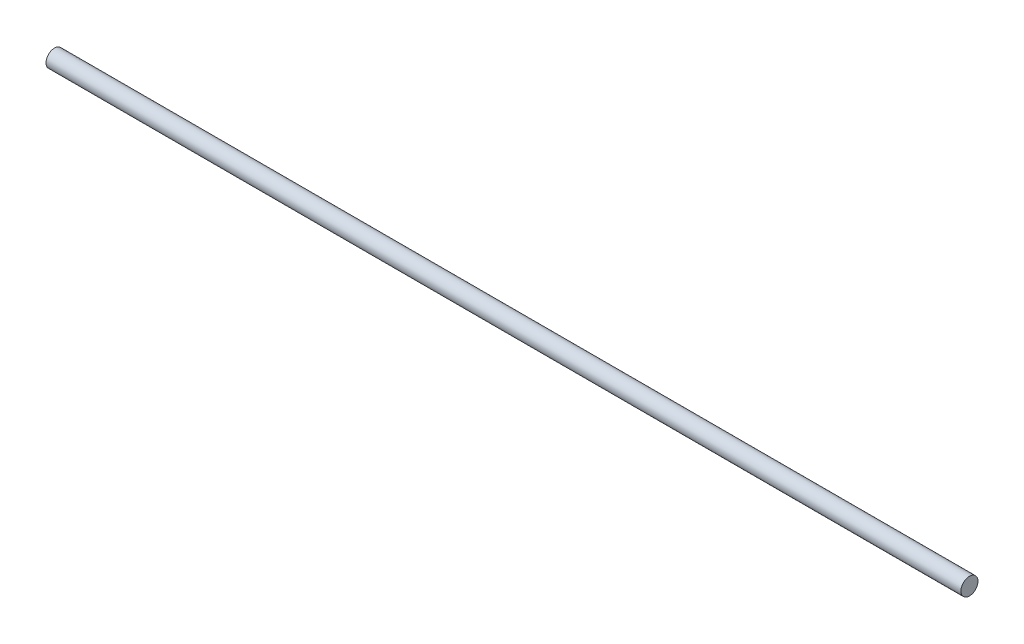
ISO-10303-21;
HEADER;
FILE_DESCRIPTION(('STEP AP214'),'2;1');
FILE_NAME('part.step','',(''),(''),'','','');
FILE_SCHEMA(('AUTOMOTIVE_DESIGN { 1 0 10303 214 1 1 1 1 }'));
ENDSEC;
DATA;
#1=APPLICATION_CONTEXT('core data for automotive mechanical design processes');
#2=APPLICATION_PROTOCOL_DEFINITION('international standard','automotive_design',2000,#1);
#3=PRODUCT_CONTEXT('',#1,'mechanical');
#4=PRODUCT('Part','Part','',(#3));
#5=PRODUCT_RELATED_PRODUCT_CATEGORY('part','',(#4));
#6=PRODUCT_DEFINITION_FORMATION('','',#4);
#7=PRODUCT_DEFINITION_CONTEXT('part definition',#1,'design');
#8=PRODUCT_DEFINITION('design','',#6,#7);
#9=PRODUCT_DEFINITION_SHAPE('','',#8);
#10=(LENGTH_UNIT() NAMED_UNIT(*) SI_UNIT(.MILLI.,.METRE.));
#11=(NAMED_UNIT(*) PLANE_ANGLE_UNIT() SI_UNIT($,.RADIAN.));
#12=(NAMED_UNIT(*) SI_UNIT($,.STERADIAN.) SOLID_ANGLE_UNIT());
#13=UNCERTAINTY_MEASURE_WITH_UNIT(LENGTH_MEASURE(1.E-05),#10,'distance_accuracy_value','');
#14=(GEOMETRIC_REPRESENTATION_CONTEXT(3) GLOBAL_UNCERTAINTY_ASSIGNED_CONTEXT((#13)) GLOBAL_UNIT_ASSIGNED_CONTEXT((#10,
#11,#12)) REPRESENTATION_CONTEXT('',''));
#15=CARTESIAN_POINT('',(0.,0.,0.));
#16=DIRECTION('',(0.,0.,1.));
#17=DIRECTION('',(1.,0.,0.));
#18=AXIS2_PLACEMENT_3D('',#15,#16,#17);
#19=CARTESIAN_POINT('',(450.,0.,0.));
#20=DIRECTION('',(-1.,0.,0.));
#21=DIRECTION('',(0.,0.,1.));
#22=AXIS2_PLACEMENT_3D('',#19,#20,#21);
#23=CYLINDRICAL_SURFACE('',#22,4.2);
#24=CARTESIAN_POINT('',(450.,0.,0.));
#25=DIRECTION('',(1.,0.,0.));
#26=DIRECTION('',(0.,0.,-1.));
#27=AXIS2_PLACEMENT_3D('',#24,#25,#26);
#28=CIRCLE('',#27,4.2);
#29=CARTESIAN_POINT('',(450.,0.,-4.2));
#30=VERTEX_POINT('',#29);
#31=EDGE_CURVE('E10',#30,#30,#28,.T.);
#32=ORIENTED_EDGE('',*,*,#31,.F.);
#33=EDGE_LOOP('',(#32));
#34=FACE_BOUND('',#33,.T.);
#35=CARTESIAN_POINT('',(0.,0.,0.));
#36=DIRECTION('',(1.,0.,0.));
#37=DIRECTION('',(0.,0.,-1.));
#38=AXIS2_PLACEMENT_3D('',#35,#36,#37);
#39=CIRCLE('',#38,4.2);
#40=CARTESIAN_POINT('',(0.,0.,-4.2));
#41=VERTEX_POINT('',#40);
#42=EDGE_CURVE('E34',#41,#41,#39,.T.);
#43=ORIENTED_EDGE('',*,*,#42,.T.);
#44=EDGE_LOOP('',(#43));
#45=FACE_BOUND('',#44,.T.);
#46=ADVANCED_FACE('F31',(#34,#45),#23,.T.);
#47=CARTESIAN_POINT('',(450.,0.,0.));
#48=DIRECTION('',(1.,0.,0.));
#49=DIRECTION('',(0.,0.,-1.));
#50=AXIS2_PLACEMENT_3D('',#47,#48,#49);
#51=PLANE('',#50);
#52=ORIENTED_EDGE('',*,*,#31,.T.);
#53=EDGE_LOOP('',(#52));
#54=FACE_BOUND('',#53,.T.);
#55=ADVANCED_FACE('F46',(#54),#51,.T.);
#56=CARTESIAN_POINT('',(0.,0.,0.));
#57=DIRECTION('',(1.,0.,0.));
#58=DIRECTION('',(0.,0.,-1.));
#59=AXIS2_PLACEMENT_3D('',#56,#57,#58);
#60=PLANE('',#59);
#61=ORIENTED_EDGE('',*,*,#42,.F.);
#62=EDGE_LOOP('',(#61));
#63=FACE_BOUND('',#62,.T.);
#64=ADVANCED_FACE('F44',(#63),#60,.F.);
#65=CLOSED_SHELL('',(#46,#55,#64));
#66=MANIFOLD_SOLID_BREP('B2',#65);
#67=ADVANCED_BREP_SHAPE_REPRESENTATION('',(#18,#66),#14);
#68=SHAPE_DEFINITION_REPRESENTATION(#9,#67);
ENDSEC;
END-ISO-10303-21;
